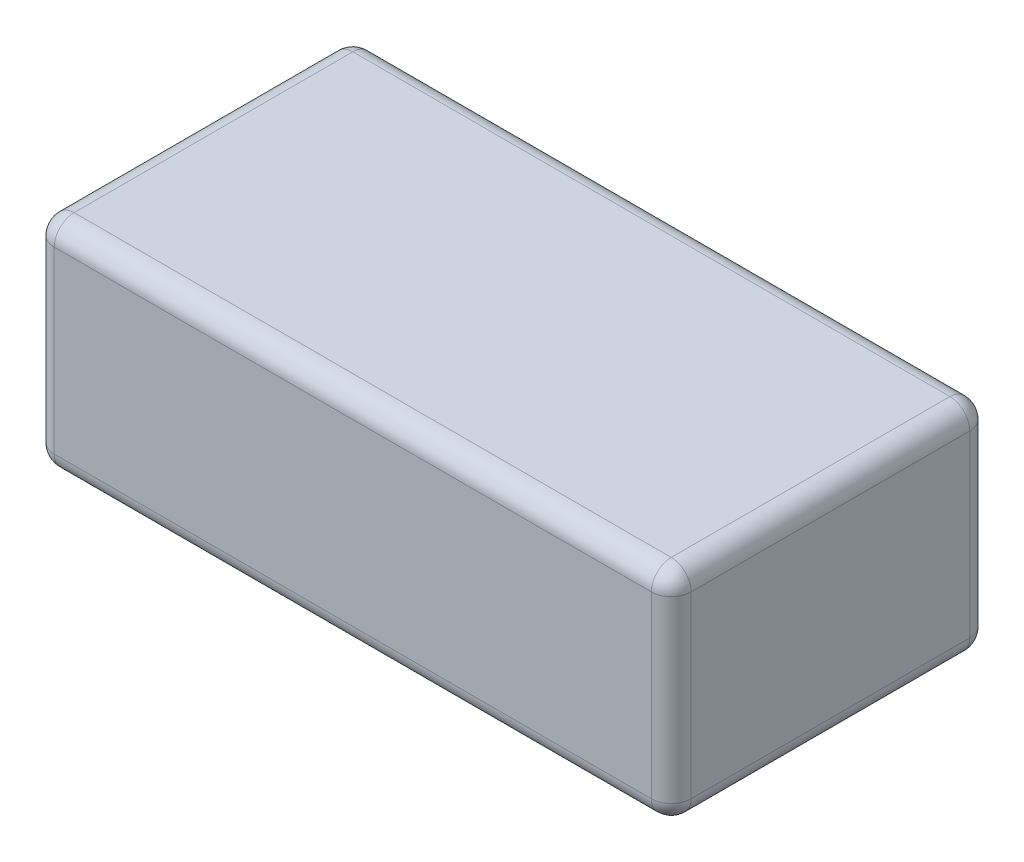
ISO-10303-21;
HEADER;
FILE_DESCRIPTION(('STEP AP214'),'2;1');
FILE_NAME('part.step','',(''),(''),'','','');
FILE_SCHEMA(('AUTOMOTIVE_DESIGN { 1 0 10303 214 1 1 1 1 }'));
ENDSEC;
DATA;
#1=APPLICATION_CONTEXT('core data for automotive mechanical design processes');
#2=APPLICATION_PROTOCOL_DEFINITION('international standard','automotive_design',2000,#1);
#3=PRODUCT_CONTEXT('',#1,'mechanical');
#4=PRODUCT('Part','Part','',(#3));
#5=PRODUCT_RELATED_PRODUCT_CATEGORY('part','',(#4));
#6=PRODUCT_DEFINITION_FORMATION('','',#4);
#7=PRODUCT_DEFINITION_CONTEXT('part definition',#1,'design');
#8=PRODUCT_DEFINITION('design','',#6,#7);
#9=PRODUCT_DEFINITION_SHAPE('','',#8);
#10=(LENGTH_UNIT() NAMED_UNIT(*) SI_UNIT(.MILLI.,.METRE.));
#11=(NAMED_UNIT(*) PLANE_ANGLE_UNIT() SI_UNIT($,.RADIAN.));
#12=(NAMED_UNIT(*) SI_UNIT($,.STERADIAN.) SOLID_ANGLE_UNIT());
#13=UNCERTAINTY_MEASURE_WITH_UNIT(LENGTH_MEASURE(1.E-05),#10,'distance_accuracy_value','');
#14=(GEOMETRIC_REPRESENTATION_CONTEXT(3) GLOBAL_UNCERTAINTY_ASSIGNED_CONTEXT((#13)) GLOBAL_UNIT_ASSIGNED_CONTEXT((#10,
#11,#12)) REPRESENTATION_CONTEXT('',''));
#15=CARTESIAN_POINT('',(0.,0.,0.));
#16=DIRECTION('',(0.,0.,1.));
#17=DIRECTION('',(1.,0.,0.));
#18=AXIS2_PLACEMENT_3D('',#15,#16,#17);
#19=CARTESIAN_POINT('',(0.75,0.05,0.35));
#20=DIRECTION('',(1.,0.,0.));
#21=DIRECTION('',(0.,0.,-1.));
#22=AXIS2_PLACEMENT_3D('',#19,#20,#21);
#23=SPHERICAL_SURFACE('',#22,0.05);
#24=CARTESIAN_POINT('',(0.75,0.05,0.35));
#25=DIRECTION('',(-1.,0.,0.));
#26=DIRECTION('',(0.,0.,1.));
#27=AXIS2_PLACEMENT_3D('',#24,#25,#26);
#28=CIRCLE('',#27,0.05);
#29=CARTESIAN_POINT('',(0.75,0.,0.35));
#30=VERTEX_POINT('',#29);
#31=CARTESIAN_POINT('',(0.75,0.050000000000024,0.4));
#32=VERTEX_POINT('',#31);
#33=EDGE_CURVE('E111',#30,#32,#28,.T.);
#34=ORIENTED_EDGE('',*,*,#33,.F.);
#35=CARTESIAN_POINT('',(0.75,0.05,0.35));
#36=DIRECTION('',(0.,0.,1.));
#37=DIRECTION('',(1.,0.,0.));
#38=AXIS2_PLACEMENT_3D('',#35,#36,#37);
#39=CIRCLE('',#38,0.05);
#40=CARTESIAN_POINT('',(0.8,0.05,0.35));
#41=VERTEX_POINT('',#40);
#42=EDGE_CURVE('E122',#41,#30,#39,.F.);
#43=ORIENTED_EDGE('',*,*,#42,.F.);
#44=CARTESIAN_POINT('',(0.75,0.05,0.35));
#45=DIRECTION('',(0.,-1.,0.));
#46=DIRECTION('',(0.,0.,-1.));
#47=AXIS2_PLACEMENT_3D('',#44,#45,#46);
#48=CIRCLE('',#47,0.05);
#49=EDGE_CURVE('E131',#32,#41,#48,.F.);
#50=ORIENTED_EDGE('',*,*,#49,.F.);
#51=EDGE_LOOP('',(#34,#43,#50));
#52=FACE_BOUND('',#51,.T.);
#53=ADVANCED_FACE('F17',(#52),#23,.T.);
#54=CARTESIAN_POINT('',(-0.75,0.05,0.35));
#55=DIRECTION('',(1.,0.,0.));
#56=DIRECTION('',(0.,0.,-1.));
#57=AXIS2_PLACEMENT_3D('',#54,#55,#56);
#58=SPHERICAL_SURFACE('',#57,0.05);
#59=CARTESIAN_POINT('',(-0.75,0.05,0.35));
#60=DIRECTION('',(0.,-1.,0.));
#61=DIRECTION('',(0.,0.,-1.));
#62=AXIS2_PLACEMENT_3D('',#59,#60,#61);
#63=CIRCLE('',#62,0.05);
#64=CARTESIAN_POINT('',(-0.8,0.05,0.35));
#65=VERTEX_POINT('',#64);
#66=CARTESIAN_POINT('',(-0.75,0.05,0.4));
#67=VERTEX_POINT('',#66);
#68=EDGE_CURVE('E261',#65,#67,#63,.F.);
#69=ORIENTED_EDGE('',*,*,#68,.F.);
#70=CARTESIAN_POINT('',(-0.75,0.05,0.35));
#71=DIRECTION('',(0.,0.,-1.));
#72=DIRECTION('',(-1.,0.,0.));
#73=AXIS2_PLACEMENT_3D('',#70,#71,#72);
#74=CIRCLE('',#73,0.05);
#75=CARTESIAN_POINT('',(-0.75,0.,0.35));
#76=VERTEX_POINT('',#75);
#77=EDGE_CURVE('E270',#76,#65,#74,.T.);
#78=ORIENTED_EDGE('',*,*,#77,.F.);
#79=CARTESIAN_POINT('',(-0.75,0.05,0.35));
#80=DIRECTION('',(-1.,0.,0.));
#81=DIRECTION('',(0.,0.,1.));
#82=AXIS2_PLACEMENT_3D('',#79,#80,#81);
#83=CIRCLE('',#82,0.05);
#84=EDGE_CURVE('E114',#67,#76,#83,.F.);
#85=ORIENTED_EDGE('',*,*,#84,.F.);
#86=EDGE_LOOP('',(#69,#78,#85));
#87=FACE_BOUND('',#86,.T.);
#88=ADVANCED_FACE('F151',(#87),#58,.T.);
#89=CARTESIAN_POINT('',(-0.75,0.05,-0.35));
#90=DIRECTION('',(1.,0.,0.));
#91=DIRECTION('',(0.,0.,-1.));
#92=AXIS2_PLACEMENT_3D('',#89,#90,#91);
#93=SPHERICAL_SURFACE('',#92,0.05);
#94=CARTESIAN_POINT('',(-0.75,0.05,-0.35));
#95=DIRECTION('',(0.,-1.,0.));
#96=DIRECTION('',(0.,0.,-1.));
#97=AXIS2_PLACEMENT_3D('',#94,#95,#96);
#98=CIRCLE('',#97,0.05);
#99=CARTESIAN_POINT('',(-0.75,0.05,-0.4));
#100=VERTEX_POINT('',#99);
#101=CARTESIAN_POINT('',(-0.8,0.05,-0.35));
#102=VERTEX_POINT('',#101);
#103=EDGE_CURVE('E256',#100,#102,#98,.F.);
#104=ORIENTED_EDGE('',*,*,#103,.F.);
#105=CARTESIAN_POINT('',(-0.75,0.05,-0.35));
#106=DIRECTION('',(1.,0.,0.));
#107=DIRECTION('',(0.,0.,-1.));
#108=AXIS2_PLACEMENT_3D('',#105,#106,#107);
#109=CIRCLE('',#108,0.05);
#110=CARTESIAN_POINT('',(-0.75,0.,-0.35));
#111=VERTEX_POINT('',#110);
#112=EDGE_CURVE('E253',#111,#100,#109,.T.);
#113=ORIENTED_EDGE('',*,*,#112,.F.);
#114=CARTESIAN_POINT('',(-0.75,0.05,-0.35));
#115=DIRECTION('',(0.,0.,-1.));
#116=DIRECTION('',(-1.,0.,0.));
#117=AXIS2_PLACEMENT_3D('',#114,#115,#116);
#118=CIRCLE('',#117,0.05);
#119=EDGE_CURVE('E267',#102,#111,#118,.F.);
#120=ORIENTED_EDGE('',*,*,#119,.F.);
#121=EDGE_LOOP('',(#104,#113,#120));
#122=FACE_BOUND('',#121,.T.);
#123=ADVANCED_FACE('F147',(#122),#93,.T.);
#124=CARTESIAN_POINT('',(0.75,0.05,-0.35));
#125=DIRECTION('',(1.,0.,0.));
#126=DIRECTION('',(0.,0.,-1.));
#127=AXIS2_PLACEMENT_3D('',#124,#125,#126);
#128=SPHERICAL_SURFACE('',#127,0.05);
#129=CARTESIAN_POINT('',(0.75,0.05,-0.35));
#130=DIRECTION('',(1.,0.,0.));
#131=DIRECTION('',(0.,0.,-1.));
#132=AXIS2_PLACEMENT_3D('',#129,#130,#131);
#133=CIRCLE('',#132,0.05);
#134=CARTESIAN_POINT('',(0.75,0.05,-0.4));
#135=VERTEX_POINT('',#134);
#136=CARTESIAN_POINT('',(0.75,0.,-0.35));
#137=VERTEX_POINT('',#136);
#138=EDGE_CURVE('E251',#135,#137,#133,.F.);
#139=ORIENTED_EDGE('',*,*,#138,.F.);
#140=CARTESIAN_POINT('',(0.75,0.05,-0.35));
#141=DIRECTION('',(0.,-1.,0.));
#142=DIRECTION('',(0.,0.,-1.));
#143=AXIS2_PLACEMENT_3D('',#140,#141,#142);
#144=CIRCLE('',#143,0.05);
#145=CARTESIAN_POINT('',(0.8,0.05,-0.35));
#146=VERTEX_POINT('',#145);
#147=EDGE_CURVE('E258',#146,#135,#144,.F.);
#148=ORIENTED_EDGE('',*,*,#147,.F.);
#149=CARTESIAN_POINT('',(0.75,0.05,-0.35));
#150=DIRECTION('',(0.,0.,1.));
#151=DIRECTION('',(1.,0.,0.));
#152=AXIS2_PLACEMENT_3D('',#149,#150,#151);
#153=CIRCLE('',#152,0.05);
#154=EDGE_CURVE('E133',#137,#146,#153,.T.);
#155=ORIENTED_EDGE('',*,*,#154,.F.);
#156=EDGE_LOOP('',(#139,#148,#155));
#157=FACE_BOUND('',#156,.T.);
#158=ADVANCED_FACE('F143',(#157),#128,.T.);
#159=CARTESIAN_POINT('',(0.75,0.05,0.4));
#160=DIRECTION('',(0.,0.,1.));
#161=DIRECTION('',(1.,0.,0.));
#162=AXIS2_PLACEMENT_3D('',#159,#160,#161);
#163=CYLINDRICAL_SURFACE('',#162,0.05);
#164=ORIENTED_EDGE('',*,*,#154,.T.);
#165=DIRECTION('',(0.,0.,1.));
#166=VECTOR('',#165,1.);
#167=CARTESIAN_POINT('',(0.8,0.05,0.4));
#168=LINE('',#167,#166);
#169=EDGE_CURVE('E127',#146,#41,#168,.T.);
#170=ORIENTED_EDGE('',*,*,#169,.T.);
#171=ORIENTED_EDGE('',*,*,#42,.T.);
#172=DIRECTION('',(0.,0.,1.));
#173=VECTOR('',#172,1.);
#174=CARTESIAN_POINT('',(0.75,0.,0.4));
#175=LINE('',#174,#173);
#176=EDGE_CURVE('E124',#30,#137,#175,.F.);
#177=ORIENTED_EDGE('',*,*,#176,.T.);
#178=EDGE_LOOP('',(#164,#170,#171,#177));
#179=FACE_BOUND('',#178,.T.);
#180=ADVANCED_FACE('F123',(#179),#163,.T.);
#181=CARTESIAN_POINT('',(0.75,0.55,0.35));
#182=DIRECTION('',(0.,-1.,0.));
#183=DIRECTION('',(0.,0.,-1.));
#184=AXIS2_PLACEMENT_3D('',#181,#182,#183);
#185=CYLINDRICAL_SURFACE('',#184,0.05);
#186=ORIENTED_EDGE('',*,*,#49,.T.);
#187=DIRECTION('',(0.,1.,0.));
#188=VECTOR('',#187,1.);
#189=CARTESIAN_POINT('',(0.8,0.55,0.35));
#190=LINE('',#189,#188);
#191=CARTESIAN_POINT('',(0.8,0.5,0.35));
#192=VERTEX_POINT('',#191);
#193=EDGE_CURVE('E247',#41,#192,#190,.T.);
#194=ORIENTED_EDGE('',*,*,#193,.T.);
#195=CARTESIAN_POINT('',(0.75,0.5,0.35));
#196=DIRECTION('',(0.,-1.,0.));
#197=DIRECTION('',(1.,0.,0.));
#198=AXIS2_PLACEMENT_3D('',#195,#196,#197);
#199=CIRCLE('',#198,0.05);
#200=CARTESIAN_POINT('',(0.75,0.5,0.4));
#201=VERTEX_POINT('',#200);
#202=EDGE_CURVE('E242',#201,#192,#199,.F.);
#203=ORIENTED_EDGE('',*,*,#202,.F.);
#204=DIRECTION('',(0.,1.,0.));
#205=VECTOR('',#204,1.);
#206=CARTESIAN_POINT('',(0.75,0.55,0.4));
#207=LINE('',#206,#205);
#208=EDGE_CURVE('E116',#201,#32,#207,.F.);
#209=ORIENTED_EDGE('',*,*,#208,.T.);
#210=EDGE_LOOP('',(#186,#194,#203,#209));
#211=FACE_BOUND('',#210,.T.);
#212=ADVANCED_FACE('F274',(#211),#185,.T.);
#213=CARTESIAN_POINT('',(-0.75,0.05,0.4));
#214=DIRECTION('',(0.,0.,-1.));
#215=DIRECTION('',(-1.,0.,0.));
#216=AXIS2_PLACEMENT_3D('',#213,#214,#215);
#217=CYLINDRICAL_SURFACE('',#216,0.05);
#218=ORIENTED_EDGE('',*,*,#119,.T.);
#219=DIRECTION('',(0.,0.,-1.));
#220=VECTOR('',#219,1.);
#221=CARTESIAN_POINT('',(-0.75,0.,0.4));
#222=LINE('',#221,#220);
#223=EDGE_CURVE('E264',#111,#76,#222,.F.);
#224=ORIENTED_EDGE('',*,*,#223,.T.);
#225=ORIENTED_EDGE('',*,*,#77,.T.);
#226=DIRECTION('',(0.,0.,-1.));
#227=VECTOR('',#226,1.);
#228=CARTESIAN_POINT('',(-0.8,0.05,0.4));
#229=LINE('',#228,#227);
#230=EDGE_CURVE('E220',#65,#102,#229,.T.);
#231=ORIENTED_EDGE('',*,*,#230,.T.);
#232=EDGE_LOOP('',(#218,#224,#225,#231));
#233=FACE_BOUND('',#232,.T.);
#234=ADVANCED_FACE('F361',(#233),#217,.T.);
#235=CARTESIAN_POINT('',(-0.75,0.55,0.35));
#236=DIRECTION('',(0.,-1.,0.));
#237=DIRECTION('',(0.,0.,-1.));
#238=AXIS2_PLACEMENT_3D('',#235,#236,#237);
#239=CYLINDRICAL_SURFACE('',#238,0.05);
#240=ORIENTED_EDGE('',*,*,#68,.T.);
#241=DIRECTION('',(0.,1.,0.));
#242=VECTOR('',#241,1.);
#243=CARTESIAN_POINT('',(-0.75,0.55,0.4));
#244=LINE('',#243,#242);
#245=CARTESIAN_POINT('',(-0.75,0.5,0.4));
#246=VERTEX_POINT('',#245);
#247=EDGE_CURVE('E241',#67,#246,#244,.T.);
#248=ORIENTED_EDGE('',*,*,#247,.T.);
#249=CARTESIAN_POINT('',(-0.75,0.5,0.35));
#250=DIRECTION('',(0.,-1.,0.));
#251=DIRECTION('',(1.,0.,0.));
#252=AXIS2_PLACEMENT_3D('',#249,#250,#251);
#253=CIRCLE('',#252,0.05);
#254=CARTESIAN_POINT('',(-0.8,0.5,0.35));
#255=VERTEX_POINT('',#254);
#256=EDGE_CURVE('E223',#255,#246,#253,.F.);
#257=ORIENTED_EDGE('',*,*,#256,.F.);
#258=DIRECTION('',(0.,1.,0.));
#259=VECTOR('',#258,1.);
#260=CARTESIAN_POINT('',(-0.8,0.55,0.35));
#261=LINE('',#260,#259);
#262=EDGE_CURVE('E214',#255,#65,#261,.F.);
#263=ORIENTED_EDGE('',*,*,#262,.T.);
#264=EDGE_LOOP('',(#240,#248,#257,#263));
#265=FACE_BOUND('',#264,.T.);
#266=ADVANCED_FACE('F359',(#265),#239,.T.);
#267=CARTESIAN_POINT('',(0.75,0.55,-0.35));
#268=DIRECTION('',(0.,-1.,0.));
#269=DIRECTION('',(0.,0.,-1.));
#270=AXIS2_PLACEMENT_3D('',#267,#268,#269);
#271=CYLINDRICAL_SURFACE('',#270,0.05);
#272=ORIENTED_EDGE('',*,*,#147,.T.);
#273=DIRECTION('',(0.,1.,0.));
#274=VECTOR('',#273,1.);
#275=CARTESIAN_POINT('',(0.75,0.55,-0.4));
#276=LINE('',#275,#274);
#277=CARTESIAN_POINT('',(0.75,0.5,-0.4));
#278=VERTEX_POINT('',#277);
#279=EDGE_CURVE('E206',#135,#278,#276,.T.);
#280=ORIENTED_EDGE('',*,*,#279,.T.);
#281=CARTESIAN_POINT('',(0.75,0.5,-0.35));
#282=DIRECTION('',(0.,1.,0.));
#283=DIRECTION('',(1.,0.,0.));
#284=AXIS2_PLACEMENT_3D('',#281,#282,#283);
#285=CIRCLE('',#284,0.05);
#286=CARTESIAN_POINT('',(0.8,0.5,-0.35));
#287=VERTEX_POINT('',#286);
#288=EDGE_CURVE('E208',#287,#278,#285,.T.);
#289=ORIENTED_EDGE('',*,*,#288,.F.);
#290=DIRECTION('',(0.,1.,0.));
#291=VECTOR('',#290,1.);
#292=CARTESIAN_POINT('',(0.8,0.55,-0.35));
#293=LINE('',#292,#291);
#294=EDGE_CURVE('E117',#287,#146,#293,.F.);
#295=ORIENTED_EDGE('',*,*,#294,.T.);
#296=EDGE_LOOP('',(#272,#280,#289,#295));
#297=FACE_BOUND('',#296,.T.);
#298=ADVANCED_FACE('F310',(#297),#271,.T.);
#299=CARTESIAN_POINT('',(-0.75,0.55,-0.35));
#300=DIRECTION('',(0.,-1.,0.));
#301=DIRECTION('',(0.,0.,-1.));
#302=AXIS2_PLACEMENT_3D('',#299,#300,#301);
#303=CYLINDRICAL_SURFACE('',#302,0.05);
#304=CARTESIAN_POINT('',(-0.75,0.5,-0.35));
#305=DIRECTION('',(0.,1.,0.));
#306=DIRECTION('',(1.,0.,0.));
#307=AXIS2_PLACEMENT_3D('',#304,#305,#306);
#308=CIRCLE('',#307,0.05);
#309=CARTESIAN_POINT('',(-0.75,0.5,-0.4));
#310=VERTEX_POINT('',#309);
#311=CARTESIAN_POINT('',(-0.8,0.5,-0.35));
#312=VERTEX_POINT('',#311);
#313=EDGE_CURVE('E210',#310,#312,#308,.T.);
#314=ORIENTED_EDGE('',*,*,#313,.F.);
#315=DIRECTION('',(0.,1.,0.));
#316=VECTOR('',#315,1.);
#317=CARTESIAN_POINT('',(-0.75,0.55,-0.4));
#318=LINE('',#317,#316);
#319=EDGE_CURVE('E300',#310,#100,#318,.F.);
#320=ORIENTED_EDGE('',*,*,#319,.T.);
#321=ORIENTED_EDGE('',*,*,#103,.T.);
#322=DIRECTION('',(0.,1.,0.));
#323=VECTOR('',#322,1.);
#324=CARTESIAN_POINT('',(-0.8,0.55,-0.35));
#325=LINE('',#324,#323);
#326=EDGE_CURVE('E217',#102,#312,#325,.T.);
#327=ORIENTED_EDGE('',*,*,#326,.T.);
#328=EDGE_LOOP('',(#314,#320,#321,#327));
#329=FACE_BOUND('',#328,.T.);
#330=ADVANCED_FACE('F351',(#329),#303,.T.);
#331=CARTESIAN_POINT('',(0.8,0.,-0.4));
#332=DIRECTION('',(0.,-1.,0.));
#333=DIRECTION('',(0.,0.,-1.));
#334=AXIS2_PLACEMENT_3D('',#331,#332,#333);
#335=PLANE('',#334);
#336=DIRECTION('',(1.,0.,0.));
#337=VECTOR('',#336,1.);
#338=CARTESIAN_POINT('',(-0.8,0.,-0.35));
#339=LINE('',#338,#337);
#340=EDGE_CURVE('E101',#137,#111,#339,.F.);
#341=ORIENTED_EDGE('',*,*,#340,.F.);
#342=ORIENTED_EDGE('',*,*,#176,.F.);
#343=DIRECTION('',(-1.,0.,0.));
#344=VECTOR('',#343,1.);
#345=CARTESIAN_POINT('',(-0.8,0.,0.35));
#346=LINE('',#345,#344);
#347=EDGE_CURVE('E107',#76,#30,#346,.F.);
#348=ORIENTED_EDGE('',*,*,#347,.F.);
#349=ORIENTED_EDGE('',*,*,#223,.F.);
#350=EDGE_LOOP('',(#341,#342,#348,#349));
#351=FACE_BOUND('',#350,.T.);
#352=ADVANCED_FACE('F135',(#351),#335,.T.);
#353=CARTESIAN_POINT('',(0.8,0.55,0.4));
#354=DIRECTION('',(-1.,0.,0.));
#355=DIRECTION('',(0.,0.,1.));
#356=AXIS2_PLACEMENT_3D('',#353,#354,#355);
#357=PLANE('',#356);
#358=DIRECTION('',(0.,0.,-1.));
#359=VECTOR('',#358,1.);
#360=CARTESIAN_POINT('',(0.8,0.5,-0.4));
#361=LINE('',#360,#359);
#362=EDGE_CURVE('E291',#192,#287,#361,.T.);
#363=ORIENTED_EDGE('',*,*,#362,.F.);
#364=ORIENTED_EDGE('',*,*,#193,.F.);
#365=ORIENTED_EDGE('',*,*,#169,.F.);
#366=ORIENTED_EDGE('',*,*,#294,.F.);
#367=EDGE_LOOP('',(#363,#364,#365,#366));
#368=FACE_BOUND('',#367,.T.);
#369=ADVANCED_FACE('F346',(#368),#357,.F.);
#370=CARTESIAN_POINT('',(-0.8,0.05,0.35));
#371=DIRECTION('',(-1.,0.,0.));
#372=DIRECTION('',(0.,0.,1.));
#373=AXIS2_PLACEMENT_3D('',#370,#371,#372);
#374=CYLINDRICAL_SURFACE('',#373,0.05);
#375=ORIENTED_EDGE('',*,*,#347,.T.);
#376=ORIENTED_EDGE('',*,*,#33,.T.);
#377=DIRECTION('',(-1.,0.,0.));
#378=VECTOR('',#377,1.);
#379=CARTESIAN_POINT('',(-0.8,0.05,0.4));
#380=LINE('',#379,#378);
#381=EDGE_CURVE('E282',#32,#67,#380,.T.);
#382=ORIENTED_EDGE('',*,*,#381,.T.);
#383=ORIENTED_EDGE('',*,*,#84,.T.);
#384=EDGE_LOOP('',(#375,#376,#382,#383));
#385=FACE_BOUND('',#384,.T.);
#386=ADVANCED_FACE('F109',(#385),#374,.T.);
#387=CARTESIAN_POINT('',(0.75,0.5,0.35));
#388=DIRECTION('',(1.,0.,0.));
#389=DIRECTION('',(0.,0.,-1.));
#390=AXIS2_PLACEMENT_3D('',#387,#388,#389);
#391=SPHERICAL_SURFACE('',#390,0.05);
#392=ORIENTED_EDGE('',*,*,#202,.T.);
#393=CARTESIAN_POINT('',(0.75,0.5,0.35));
#394=DIRECTION('',(0.,0.,-1.));
#395=DIRECTION('',(-1.,0.,0.));
#396=AXIS2_PLACEMENT_3D('',#393,#394,#395);
#397=CIRCLE('',#396,0.05);
#398=CARTESIAN_POINT('',(0.75,0.55,0.35));
#399=VERTEX_POINT('',#398);
#400=EDGE_CURVE('E297',#399,#192,#397,.T.);
#401=ORIENTED_EDGE('',*,*,#400,.F.);
#402=CARTESIAN_POINT('',(0.75,0.5,0.35));
#403=DIRECTION('',(1.,0.,0.));
#404=DIRECTION('',(0.,0.,-1.));
#405=AXIS2_PLACEMENT_3D('',#402,#403,#404);
#406=CIRCLE('',#405,0.05);
#407=EDGE_CURVE('E284',#201,#399,#406,.F.);
#408=ORIENTED_EDGE('',*,*,#407,.F.);
#409=EDGE_LOOP('',(#392,#401,#408));
#410=FACE_BOUND('',#409,.T.);
#411=ADVANCED_FACE('F232',(#410),#391,.T.);
#412=CARTESIAN_POINT('',(-0.75,0.5,0.35));
#413=DIRECTION('',(1.,0.,0.));
#414=DIRECTION('',(0.,0.,-1.));
#415=AXIS2_PLACEMENT_3D('',#412,#413,#414);
#416=SPHERICAL_SURFACE('',#415,0.05);
#417=ORIENTED_EDGE('',*,*,#256,.T.);
#418=CARTESIAN_POINT('',(-0.75,0.5,0.35));
#419=DIRECTION('',(1.,0.,0.));
#420=DIRECTION('',(0.,0.,-1.));
#421=AXIS2_PLACEMENT_3D('',#418,#419,#420);
#422=CIRCLE('',#421,0.05);
#423=CARTESIAN_POINT('',(-0.75,0.55,0.35));
#424=VERTEX_POINT('',#423);
#425=EDGE_CURVE('E288',#424,#246,#422,.T.);
#426=ORIENTED_EDGE('',*,*,#425,.F.);
#427=CARTESIAN_POINT('',(-0.75,0.5,0.35));
#428=DIRECTION('',(0.,0.,1.));
#429=DIRECTION('',(1.,0.,0.));
#430=AXIS2_PLACEMENT_3D('',#427,#428,#429);
#431=CIRCLE('',#430,0.05);
#432=EDGE_CURVE('E331',#255,#424,#431,.F.);
#433=ORIENTED_EDGE('',*,*,#432,.F.);
#434=EDGE_LOOP('',(#417,#426,#433));
#435=FACE_BOUND('',#434,.T.);
#436=ADVANCED_FACE('F228',(#435),#416,.T.);
#437=CARTESIAN_POINT('',(-0.8,0.55,0.4));
#438=DIRECTION('',(1.,0.,0.));
#439=DIRECTION('',(0.,0.,-1.));
#440=AXIS2_PLACEMENT_3D('',#437,#438,#439);
#441=PLANE('',#440);
#442=DIRECTION('',(0.,0.,1.));
#443=VECTOR('',#442,1.);
#444=CARTESIAN_POINT('',(-0.8,0.5,-0.4));
#445=LINE('',#444,#443);
#446=EDGE_CURVE('E322',#312,#255,#445,.T.);
#447=ORIENTED_EDGE('',*,*,#446,.F.);
#448=ORIENTED_EDGE('',*,*,#326,.F.);
#449=ORIENTED_EDGE('',*,*,#230,.F.);
#450=ORIENTED_EDGE('',*,*,#262,.F.);
#451=EDGE_LOOP('',(#447,#448,#449,#450));
#452=FACE_BOUND('',#451,.T.);
#453=ADVANCED_FACE('F231',(#452),#441,.F.);
#454=CARTESIAN_POINT('',(-0.75,0.5,-0.35));
#455=DIRECTION('',(1.,0.,0.));
#456=DIRECTION('',(0.,0.,-1.));
#457=AXIS2_PLACEMENT_3D('',#454,#455,#456);
#458=SPHERICAL_SURFACE('',#457,0.05);
#459=CARTESIAN_POINT('',(-0.75,0.5,-0.35));
#460=DIRECTION('',(0.,0.,1.));
#461=DIRECTION('',(1.,0.,0.));
#462=AXIS2_PLACEMENT_3D('',#459,#460,#461);
#463=CIRCLE('',#462,0.05);
#464=CARTESIAN_POINT('',(-0.75,0.55,-0.350000000000096));
#465=VERTEX_POINT('',#464);
#466=EDGE_CURVE('E328',#465,#312,#463,.T.);
#467=ORIENTED_EDGE('',*,*,#466,.F.);
#468=CARTESIAN_POINT('',(-0.75,0.5,-0.35));
#469=DIRECTION('',(-1.,0.,0.));
#470=DIRECTION('',(0.,0.,1.));
#471=AXIS2_PLACEMENT_3D('',#468,#469,#470);
#472=CIRCLE('',#471,0.05);
#473=EDGE_CURVE('E318',#310,#465,#472,.F.);
#474=ORIENTED_EDGE('',*,*,#473,.F.);
#475=ORIENTED_EDGE('',*,*,#313,.T.);
#476=EDGE_LOOP('',(#467,#474,#475));
#477=FACE_BOUND('',#476,.T.);
#478=ADVANCED_FACE('F199',(#477),#458,.T.);
#479=CARTESIAN_POINT('',(0.75,0.5,-0.35));
#480=DIRECTION('',(1.,0.,0.));
#481=DIRECTION('',(0.,0.,-1.));
#482=AXIS2_PLACEMENT_3D('',#479,#480,#481);
#483=SPHERICAL_SURFACE('',#482,0.05);
#484=CARTESIAN_POINT('',(0.75,0.5,-0.35));
#485=DIRECTION('',(0.,0.,-1.));
#486=DIRECTION('',(-1.,0.,0.));
#487=AXIS2_PLACEMENT_3D('',#484,#485,#486);
#488=CIRCLE('',#487,0.05);
#489=CARTESIAN_POINT('',(0.75,0.55,-0.35));
#490=VERTEX_POINT('',#489);
#491=EDGE_CURVE('E285',#287,#490,#488,.F.);
#492=ORIENTED_EDGE('',*,*,#491,.F.);
#493=ORIENTED_EDGE('',*,*,#288,.T.);
#494=CARTESIAN_POINT('',(0.75,0.5,-0.35));
#495=DIRECTION('',(-1.,0.,0.));
#496=DIRECTION('',(0.,0.,1.));
#497=AXIS2_PLACEMENT_3D('',#494,#495,#496);
#498=CIRCLE('',#497,0.05);
#499=EDGE_CURVE('E315',#490,#278,#498,.T.);
#500=ORIENTED_EDGE('',*,*,#499,.F.);
#501=EDGE_LOOP('',(#492,#493,#500));
#502=FACE_BOUND('',#501,.T.);
#503=ADVANCED_FACE('F194',(#502),#483,.T.);
#504=CARTESIAN_POINT('',(-0.8,0.05,-0.35));
#505=DIRECTION('',(1.,0.,0.));
#506=DIRECTION('',(0.,0.,-1.));
#507=AXIS2_PLACEMENT_3D('',#504,#505,#506);
#508=CYLINDRICAL_SURFACE('',#507,0.05);
#509=DIRECTION('',(1.,0.,0.));
#510=VECTOR('',#509,1.);
#511=CARTESIAN_POINT('',(-0.8,0.05,-0.4));
#512=LINE('',#511,#510);
#513=EDGE_CURVE('E317',#100,#135,#512,.T.);
#514=ORIENTED_EDGE('',*,*,#513,.T.);
#515=ORIENTED_EDGE('',*,*,#138,.T.);
#516=ORIENTED_EDGE('',*,*,#340,.T.);
#517=ORIENTED_EDGE('',*,*,#112,.T.);
#518=EDGE_LOOP('',(#514,#515,#516,#517));
#519=FACE_BOUND('',#518,.T.);
#520=ADVANCED_FACE('F190',(#519),#508,.T.);
#521=CARTESIAN_POINT('',(0.75,0.5,-0.4));
#522=DIRECTION('',(0.,0.,-1.));
#523=DIRECTION('',(-1.,0.,0.));
#524=AXIS2_PLACEMENT_3D('',#521,#522,#523);
#525=CYLINDRICAL_SURFACE('',#524,0.05);
#526=ORIENTED_EDGE('',*,*,#491,.T.);
#527=DIRECTION('',(0.,0.,-1.));
#528=VECTOR('',#527,1.);
#529=CARTESIAN_POINT('',(0.75,0.55,-0.4));
#530=LINE('',#529,#528);
#531=EDGE_CURVE('E320',#490,#399,#530,.F.);
#532=ORIENTED_EDGE('',*,*,#531,.T.);
#533=ORIENTED_EDGE('',*,*,#400,.T.);
#534=ORIENTED_EDGE('',*,*,#362,.T.);
#535=EDGE_LOOP('',(#526,#532,#533,#534));
#536=FACE_BOUND('',#535,.T.);
#537=ADVANCED_FACE('F186',(#536),#525,.T.);
#538=CARTESIAN_POINT('',(-0.8,0.55,0.4));
#539=DIRECTION('',(0.,0.,-1.));
#540=DIRECTION('',(-1.,0.,0.));
#541=AXIS2_PLACEMENT_3D('',#538,#539,#540);
#542=PLANE('',#541);
#543=DIRECTION('',(1.,0.,0.));
#544=VECTOR('',#543,1.);
#545=CARTESIAN_POINT('',(0.8,0.5,0.4));
#546=LINE('',#545,#544);
#547=EDGE_CURVE('E280',#246,#201,#546,.T.);
#548=ORIENTED_EDGE('',*,*,#547,.F.);
#549=ORIENTED_EDGE('',*,*,#247,.F.);
#550=ORIENTED_EDGE('',*,*,#381,.F.);
#551=ORIENTED_EDGE('',*,*,#208,.F.);
#552=EDGE_LOOP('',(#548,#549,#550,#551));
#553=FACE_BOUND('',#552,.T.);
#554=ADVANCED_FACE('F182',(#553),#542,.F.);
#555=CARTESIAN_POINT('',(-0.75,0.5,-0.4));
#556=DIRECTION('',(0.,0.,1.));
#557=DIRECTION('',(1.,0.,0.));
#558=AXIS2_PLACEMENT_3D('',#555,#556,#557);
#559=CYLINDRICAL_SURFACE('',#558,0.05);
#560=ORIENTED_EDGE('',*,*,#466,.T.);
#561=ORIENTED_EDGE('',*,*,#446,.T.);
#562=ORIENTED_EDGE('',*,*,#432,.T.);
#563=DIRECTION('',(0.,0.,-1.));
#564=VECTOR('',#563,1.);
#565=CARTESIAN_POINT('',(-0.75,0.55,-0.4));
#566=LINE('',#565,#564);
#567=EDGE_CURVE('E338',#424,#465,#566,.T.);
#568=ORIENTED_EDGE('',*,*,#567,.T.);
#569=EDGE_LOOP('',(#560,#561,#562,#568));
#570=FACE_BOUND('',#569,.T.);
#571=ADVANCED_FACE('F178',(#570),#559,.T.);
#572=CARTESIAN_POINT('',(-0.8,0.55,-0.4));
#573=DIRECTION('',(0.,0.,1.));
#574=DIRECTION('',(1.,0.,0.));
#575=AXIS2_PLACEMENT_3D('',#572,#573,#574);
#576=PLANE('',#575);
#577=ORIENTED_EDGE('',*,*,#513,.F.);
#578=ORIENTED_EDGE('',*,*,#319,.F.);
#579=DIRECTION('',(-1.,0.,0.));
#580=VECTOR('',#579,1.);
#581=CARTESIAN_POINT('',(0.8,0.5,-0.4));
#582=LINE('',#581,#580);
#583=EDGE_CURVE('E316',#278,#310,#582,.T.);
#584=ORIENTED_EDGE('',*,*,#583,.F.);
#585=ORIENTED_EDGE('',*,*,#279,.F.);
#586=EDGE_LOOP('',(#577,#578,#584,#585));
#587=FACE_BOUND('',#586,.T.);
#588=ADVANCED_FACE('F174',(#587),#576,.F.);
#589=CARTESIAN_POINT('',(0.8,0.5,0.35));
#590=DIRECTION('',(1.,0.,0.));
#591=DIRECTION('',(0.,0.,-1.));
#592=AXIS2_PLACEMENT_3D('',#589,#590,#591);
#593=CYLINDRICAL_SURFACE('',#592,0.05);
#594=ORIENTED_EDGE('',*,*,#547,.T.);
#595=ORIENTED_EDGE('',*,*,#407,.T.);
#596=DIRECTION('',(1.,0.,0.));
#597=VECTOR('',#596,1.);
#598=CARTESIAN_POINT('',(0.8,0.55,0.35));
#599=LINE('',#598,#597);
#600=EDGE_CURVE('E26',#399,#424,#599,.F.);
#601=ORIENTED_EDGE('',*,*,#600,.T.);
#602=ORIENTED_EDGE('',*,*,#425,.T.);
#603=EDGE_LOOP('',(#594,#595,#601,#602));
#604=FACE_BOUND('',#603,.T.);
#605=ADVANCED_FACE('F168',(#604),#593,.T.);
#606=CARTESIAN_POINT('',(0.8,0.5,-0.35));
#607=DIRECTION('',(-1.,0.,0.));
#608=DIRECTION('',(0.,0.,1.));
#609=AXIS2_PLACEMENT_3D('',#606,#607,#608);
#610=CYLINDRICAL_SURFACE('',#609,0.05);
#611=DIRECTION('',(1.,0.,0.));
#612=VECTOR('',#611,1.);
#613=CARTESIAN_POINT('',(0.8,0.55,-0.35));
#614=LINE('',#613,#612);
#615=EDGE_CURVE('E11',#465,#490,#614,.T.);
#616=ORIENTED_EDGE('',*,*,#615,.T.);
#617=ORIENTED_EDGE('',*,*,#499,.T.);
#618=ORIENTED_EDGE('',*,*,#583,.T.);
#619=ORIENTED_EDGE('',*,*,#473,.T.);
#620=EDGE_LOOP('',(#616,#617,#618,#619));
#621=FACE_BOUND('',#620,.T.);
#622=ADVANCED_FACE('F163',(#621),#610,.T.);
#623=CARTESIAN_POINT('',(0.8,0.55,-0.4));
#624=DIRECTION('',(0.,-1.,0.));
#625=DIRECTION('',(0.,0.,-1.));
#626=AXIS2_PLACEMENT_3D('',#623,#624,#625);
#627=PLANE('',#626);
#628=ORIENTED_EDGE('',*,*,#615,.F.);
#629=ORIENTED_EDGE('',*,*,#567,.F.);
#630=ORIENTED_EDGE('',*,*,#600,.F.);
#631=ORIENTED_EDGE('',*,*,#531,.F.);
#632=EDGE_LOOP('',(#628,#629,#630,#631));
#633=FACE_BOUND('',#632,.T.);
#634=ADVANCED_FACE('F161',(#633),#627,.F.);
#635=CLOSED_SHELL('',(#53,#88,#123,#158,#180,#212,#234,#266,#298,#330,#352,#369,#386,#411,#436,
#453,#478,#503,#520,#537,#554,#571,#588,#605,#622,#634));
#636=MANIFOLD_SOLID_BREP('B1',#635);
#637=ADVANCED_BREP_SHAPE_REPRESENTATION('',(#18,#636),#14);
#638=SHAPE_DEFINITION_REPRESENTATION(#9,#637);
ENDSEC;
END-ISO-10303-21;
